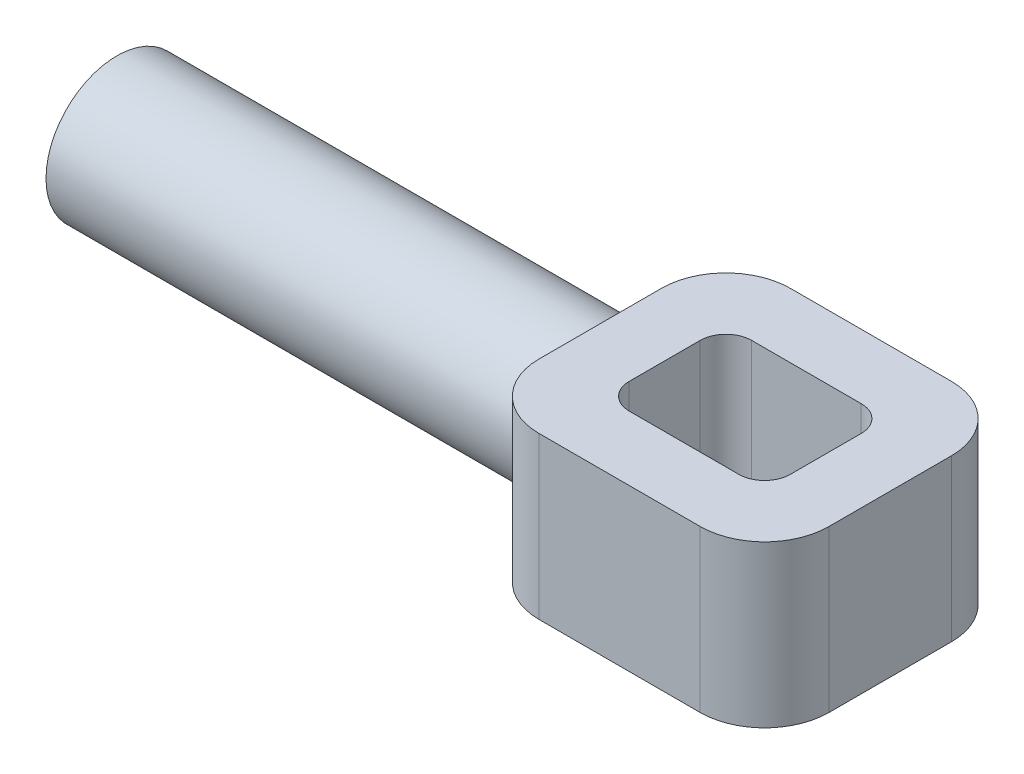
ISO-10303-21;
HEADER;
FILE_DESCRIPTION(('STEP AP214'),'2;1');
FILE_NAME('part.step','',(''),(''),'','','');
FILE_SCHEMA(('AUTOMOTIVE_DESIGN { 1 0 10303 214 1 1 1 1 }'));
ENDSEC;
DATA;
#1=APPLICATION_CONTEXT('core data for automotive mechanical design processes');
#2=APPLICATION_PROTOCOL_DEFINITION('international standard','automotive_design',2000,#1);
#3=PRODUCT_CONTEXT('',#1,'mechanical');
#4=PRODUCT('Part','Part','',(#3));
#5=PRODUCT_RELATED_PRODUCT_CATEGORY('part','',(#4));
#6=PRODUCT_DEFINITION_FORMATION('','',#4);
#7=PRODUCT_DEFINITION_CONTEXT('part definition',#1,'design');
#8=PRODUCT_DEFINITION('design','',#6,#7);
#9=PRODUCT_DEFINITION_SHAPE('','',#8);
#10=(LENGTH_UNIT() NAMED_UNIT(*) SI_UNIT(.MILLI.,.METRE.));
#11=(NAMED_UNIT(*) PLANE_ANGLE_UNIT() SI_UNIT($,.RADIAN.));
#12=(NAMED_UNIT(*) SI_UNIT($,.STERADIAN.) SOLID_ANGLE_UNIT());
#13=UNCERTAINTY_MEASURE_WITH_UNIT(LENGTH_MEASURE(1.E-05),#10,'distance_accuracy_value','');
#14=(GEOMETRIC_REPRESENTATION_CONTEXT(3) GLOBAL_UNCERTAINTY_ASSIGNED_CONTEXT((#13)) GLOBAL_UNIT_ASSIGNED_CONTEXT((#10,
#11,#12)) REPRESENTATION_CONTEXT('',''));
#15=CARTESIAN_POINT('',(0.,0.,0.));
#16=DIRECTION('',(0.,0.,1.));
#17=DIRECTION('',(1.,0.,0.));
#18=AXIS2_PLACEMENT_3D('',#15,#16,#17);
#19=CARTESIAN_POINT('',(-22.5,25.,-9.5));
#20=DIRECTION('',(1.,0.,0.));
#21=DIRECTION('',(0.,0.,-1.));
#22=AXIS2_PLACEMENT_3D('',#19,#20,#21);
#23=PLANE('',#22);
#24=CARTESIAN_POINT('',(-22.5,12.5,0.));
#25=DIRECTION('',(-1.,0.,0.));
#26=DIRECTION('',(0.,0.,1.));
#27=AXIS2_PLACEMENT_3D('',#24,#25,#26);
#28=CIRCLE('',#27,11.);
#29=CARTESIAN_POINT('',(-22.5,6.95473174679529,-9.5));
#30=VERTEX_POINT('',#29);
#31=CARTESIAN_POINT('',(-22.5,6.95473174679529,9.5));
#32=VERTEX_POINT('',#31);
#33=EDGE_CURVE('E76',#30,#32,#28,.T.);
#34=ORIENTED_EDGE('',*,*,#33,.F.);
#35=DIRECTION('',(0.,-1.,0.));
#36=VECTOR('',#35,1.);
#37=CARTESIAN_POINT('',(-22.5,25.,-9.5));
#38=LINE('',#37,#36);
#39=CARTESIAN_POINT('',(-22.5,0.,-9.5));
#40=VERTEX_POINT('',#39);
#41=EDGE_CURVE('E295',#30,#40,#38,.T.);
#42=ORIENTED_EDGE('',*,*,#41,.T.);
#43=DIRECTION('',(0.,0.,1.));
#44=VECTOR('',#43,1.);
#45=CARTESIAN_POINT('',(-22.5,0.,-9.5));
#46=LINE('',#45,#44);
#47=CARTESIAN_POINT('',(-22.5,0.,9.5));
#48=VERTEX_POINT('',#47);
#49=EDGE_CURVE('E267',#40,#48,#46,.T.);
#50=ORIENTED_EDGE('',*,*,#49,.T.);
#51=DIRECTION('',(0.,-1.,0.));
#52=VECTOR('',#51,1.);
#53=CARTESIAN_POINT('',(-22.5,25.,9.5));
#54=LINE('',#53,#52);
#55=EDGE_CURVE('E199',#48,#32,#54,.F.);
#56=ORIENTED_EDGE('',*,*,#55,.T.);
#57=EDGE_LOOP('',(#34,#42,#50,#56));
#58=FACE_BOUND('',#57,.T.);
#59=ADVANCED_FACE('F61',(#58),#23,.F.);
#60=CARTESIAN_POINT('',(0.,25.,0.));
#61=DIRECTION('',(0.,1.,0.));
#62=DIRECTION('',(0.,0.,1.));
#63=AXIS2_PLACEMENT_3D('',#60,#61,#62);
#64=PLANE('',#63);
#65=DIRECTION('',(0.,0.,-1.));
#66=VECTOR('',#65,1.);
#67=CARTESIAN_POINT('',(22.5,25.,-9.5));
#68=LINE('',#67,#66);
#69=CARTESIAN_POINT('',(22.5,25.,9.5));
#70=VERTEX_POINT('',#69);
#71=CARTESIAN_POINT('',(22.5,25.,-9.5));
#72=VERTEX_POINT('',#71);
#73=EDGE_CURVE('E249',#70,#72,#68,.T.);
#74=ORIENTED_EDGE('',*,*,#73,.T.);
#75=CARTESIAN_POINT('',(12.5,25.,-9.5));
#76=DIRECTION('',(0.,1.,0.));
#77=DIRECTION('',(0.,0.,1.));
#78=AXIS2_PLACEMENT_3D('',#75,#76,#77);
#79=CIRCLE('',#78,10.);
#80=CARTESIAN_POINT('',(12.5,25.,-19.5));
#81=VERTEX_POINT('',#80);
#82=EDGE_CURVE('E197',#72,#81,#79,.T.);
#83=ORIENTED_EDGE('',*,*,#82,.T.);
#84=DIRECTION('',(-1.,0.,0.));
#85=VECTOR('',#84,1.);
#86=CARTESIAN_POINT('',(-12.5,25.,-19.5));
#87=LINE('',#86,#85);
#88=CARTESIAN_POINT('',(-12.5,25.,-19.5));
#89=VERTEX_POINT('',#88);
#90=EDGE_CURVE('E252',#81,#89,#87,.T.);
#91=ORIENTED_EDGE('',*,*,#90,.T.);
#92=CARTESIAN_POINT('',(-12.5,25.,-9.5));
#93=DIRECTION('',(0.,1.,0.));
#94=DIRECTION('',(0.,0.,1.));
#95=AXIS2_PLACEMENT_3D('',#92,#93,#94);
#96=CIRCLE('',#95,10.);
#97=CARTESIAN_POINT('',(-22.5,25.,-9.5));
#98=VERTEX_POINT('',#97);
#99=EDGE_CURVE('E292',#89,#98,#96,.T.);
#100=ORIENTED_EDGE('',*,*,#99,.T.);
#101=DIRECTION('',(0.,0.,1.));
#102=VECTOR('',#101,1.);
#103=CARTESIAN_POINT('',(-22.5,25.,-9.5));
#104=LINE('',#103,#102);
#105=CARTESIAN_POINT('',(-22.5,25.,9.5));
#106=VERTEX_POINT('',#105);
#107=EDGE_CURVE('E256',#98,#106,#104,.T.);
#108=ORIENTED_EDGE('',*,*,#107,.T.);
#109=CARTESIAN_POINT('',(-12.5,25.,9.5));
#110=DIRECTION('',(0.,1.,0.));
#111=DIRECTION('',(0.,0.,1.));
#112=AXIS2_PLACEMENT_3D('',#109,#110,#111);
#113=CIRCLE('',#112,10.);
#114=CARTESIAN_POINT('',(-12.5,25.,19.5));
#115=VERTEX_POINT('',#114);
#116=EDGE_CURVE('E193',#106,#115,#113,.T.);
#117=ORIENTED_EDGE('',*,*,#116,.T.);
#118=DIRECTION('',(1.,0.,0.));
#119=VECTOR('',#118,1.);
#120=CARTESIAN_POINT('',(-12.5,25.,19.5));
#121=LINE('',#120,#119);
#122=CARTESIAN_POINT('',(12.5,25.,19.5));
#123=VERTEX_POINT('',#122);
#124=EDGE_CURVE('E258',#115,#123,#121,.T.);
#125=ORIENTED_EDGE('',*,*,#124,.T.);
#126=CARTESIAN_POINT('',(12.5,25.,9.5));
#127=DIRECTION('',(0.,1.,0.));
#128=DIRECTION('',(0.,0.,1.));
#129=AXIS2_PLACEMENT_3D('',#126,#127,#128);
#130=CIRCLE('',#129,10.);
#131=EDGE_CURVE('E289',#123,#70,#130,.T.);
#132=ORIENTED_EDGE('',*,*,#131,.T.);
#133=EDGE_LOOP('',(#74,#83,#91,#100,#108,#117,#125,#132));
#134=FACE_BOUND('',#133,.T.);
#135=DIRECTION('',(-1.,0.,0.));
#136=VECTOR('',#135,1.);
#137=CARTESIAN_POINT('',(-12.5,25.,-9.5));
#138=LINE('',#137,#136);
#139=CARTESIAN_POINT('',(8.5,25.,-9.5));
#140=VERTEX_POINT('',#139);
#141=CARTESIAN_POINT('',(-8.5,25.,-9.5));
#142=VERTEX_POINT('',#141);
#143=EDGE_CURVE('E228',#140,#142,#138,.T.);
#144=ORIENTED_EDGE('',*,*,#143,.F.);
#145=CARTESIAN_POINT('',(8.5,25.,-5.5));
#146=DIRECTION('',(0.,1.,0.));
#147=DIRECTION('',(0.,0.,1.));
#148=AXIS2_PLACEMENT_3D('',#145,#146,#147);
#149=CIRCLE('',#148,4.);
#150=CARTESIAN_POINT('',(12.5,25.,-5.5));
#151=VERTEX_POINT('',#150);
#152=EDGE_CURVE('E328',#140,#151,#149,.F.);
#153=ORIENTED_EDGE('',*,*,#152,.T.);
#154=DIRECTION('',(0.,0.,-1.));
#155=VECTOR('',#154,1.);
#156=CARTESIAN_POINT('',(12.5,25.,-9.5));
#157=LINE('',#156,#155);
#158=CARTESIAN_POINT('',(12.5,25.,5.5));
#159=VERTEX_POINT('',#158);
#160=EDGE_CURVE('E225',#159,#151,#157,.T.);
#161=ORIENTED_EDGE('',*,*,#160,.F.);
#162=CARTESIAN_POINT('',(8.5,25.,5.5));
#163=DIRECTION('',(0.,1.,0.));
#164=DIRECTION('',(0.,0.,1.));
#165=AXIS2_PLACEMENT_3D('',#162,#163,#164);
#166=CIRCLE('',#165,4.);
#167=CARTESIAN_POINT('',(8.5,25.,9.5));
#168=VERTEX_POINT('',#167);
#169=EDGE_CURVE('E12',#159,#168,#166,.F.);
#170=ORIENTED_EDGE('',*,*,#169,.T.);
#171=DIRECTION('',(1.,0.,0.));
#172=VECTOR('',#171,1.);
#173=CARTESIAN_POINT('',(-12.5,25.,9.5));
#174=LINE('',#173,#172);
#175=CARTESIAN_POINT('',(-8.5,25.,9.5));
#176=VERTEX_POINT('',#175);
#177=EDGE_CURVE('E235',#176,#168,#174,.T.);
#178=ORIENTED_EDGE('',*,*,#177,.F.);
#179=CARTESIAN_POINT('',(-8.5,25.,5.5));
#180=DIRECTION('',(0.,1.,0.));
#181=DIRECTION('',(0.,0.,1.));
#182=AXIS2_PLACEMENT_3D('',#179,#180,#181);
#183=CIRCLE('',#182,4.);
#184=CARTESIAN_POINT('',(-12.5,25.,5.5));
#185=VERTEX_POINT('',#184);
#186=EDGE_CURVE('E332',#176,#185,#183,.F.);
#187=ORIENTED_EDGE('',*,*,#186,.T.);
#188=DIRECTION('',(0.,0.,1.));
#189=VECTOR('',#188,1.);
#190=CARTESIAN_POINT('',(-12.5,25.,-9.5));
#191=LINE('',#190,#189);
#192=CARTESIAN_POINT('',(-12.5,25.,-5.5));
#193=VERTEX_POINT('',#192);
#194=EDGE_CURVE('E232',#193,#185,#191,.T.);
#195=ORIENTED_EDGE('',*,*,#194,.F.);
#196=CARTESIAN_POINT('',(-8.5,25.,-5.5));
#197=DIRECTION('',(0.,1.,0.));
#198=DIRECTION('',(0.,0.,1.));
#199=AXIS2_PLACEMENT_3D('',#196,#197,#198);
#200=CIRCLE('',#199,4.);
#201=EDGE_CURVE('E324',#193,#142,#200,.F.);
#202=ORIENTED_EDGE('',*,*,#201,.T.);
#203=EDGE_LOOP('',(#144,#153,#161,#170,#178,#187,#195,#202));
#204=FACE_BOUND('',#203,.T.);
#205=ADVANCED_FACE('F348',(#134,#204),#64,.T.);
#206=CARTESIAN_POINT('',(0.,0.,0.));
#207=DIRECTION('',(0.,1.,0.));
#208=DIRECTION('',(0.,0.,1.));
#209=AXIS2_PLACEMENT_3D('',#206,#207,#208);
#210=PLANE('',#209);
#211=DIRECTION('',(-1.,0.,0.));
#212=VECTOR('',#211,1.);
#213=CARTESIAN_POINT('',(-12.5,0.,-19.5));
#214=LINE('',#213,#212);
#215=CARTESIAN_POINT('',(12.5,0.,-19.5));
#216=VERTEX_POINT('',#215);
#217=CARTESIAN_POINT('',(-12.5,0.,-19.5));
#218=VERTEX_POINT('',#217);
#219=EDGE_CURVE('E264',#216,#218,#214,.T.);
#220=ORIENTED_EDGE('',*,*,#219,.F.);
#221=CARTESIAN_POINT('',(12.5,0.,-9.5));
#222=DIRECTION('',(0.,1.,0.));
#223=DIRECTION('',(0.,0.,1.));
#224=AXIS2_PLACEMENT_3D('',#221,#222,#223);
#225=CIRCLE('',#224,10.);
#226=CARTESIAN_POINT('',(22.5,0.,-9.5));
#227=VERTEX_POINT('',#226);
#228=EDGE_CURVE('E282',#216,#227,#225,.F.);
#229=ORIENTED_EDGE('',*,*,#228,.T.);
#230=DIRECTION('',(0.,0.,-1.));
#231=VECTOR('',#230,1.);
#232=CARTESIAN_POINT('',(22.5,0.,-9.5));
#233=LINE('',#232,#231);
#234=CARTESIAN_POINT('',(22.5,0.,9.5));
#235=VERTEX_POINT('',#234);
#236=EDGE_CURVE('E238',#235,#227,#233,.T.);
#237=ORIENTED_EDGE('',*,*,#236,.F.);
#238=CARTESIAN_POINT('',(12.5,0.,9.5));
#239=DIRECTION('',(0.,1.,0.));
#240=DIRECTION('',(0.,0.,1.));
#241=AXIS2_PLACEMENT_3D('',#238,#239,#240);
#242=CIRCLE('',#241,10.);
#243=CARTESIAN_POINT('',(12.5,0.,19.5));
#244=VERTEX_POINT('',#243);
#245=EDGE_CURVE('E276',#235,#244,#242,.F.);
#246=ORIENTED_EDGE('',*,*,#245,.T.);
#247=DIRECTION('',(1.,0.,0.));
#248=VECTOR('',#247,1.);
#249=CARTESIAN_POINT('',(-12.5,0.,19.5));
#250=LINE('',#249,#248);
#251=CARTESIAN_POINT('',(-12.5,0.,19.5));
#252=VERTEX_POINT('',#251);
#253=EDGE_CURVE('E253',#252,#244,#250,.T.);
#254=ORIENTED_EDGE('',*,*,#253,.F.);
#255=CARTESIAN_POINT('',(-12.5,0.,9.5));
#256=DIRECTION('',(0.,1.,0.));
#257=DIRECTION('',(0.,0.,1.));
#258=AXIS2_PLACEMENT_3D('',#255,#256,#257);
#259=CIRCLE('',#258,10.);
#260=EDGE_CURVE('E278',#252,#48,#259,.F.);
#261=ORIENTED_EDGE('',*,*,#260,.T.);
#262=ORIENTED_EDGE('',*,*,#49,.F.);
#263=CARTESIAN_POINT('',(-12.5,0.,-9.5));
#264=DIRECTION('',(0.,1.,0.));
#265=DIRECTION('',(0.,0.,1.));
#266=AXIS2_PLACEMENT_3D('',#263,#264,#265);
#267=CIRCLE('',#266,10.);
#268=EDGE_CURVE('E280',#40,#218,#267,.F.);
#269=ORIENTED_EDGE('',*,*,#268,.T.);
#270=EDGE_LOOP('',(#220,#229,#237,#246,#254,#261,#262,#269));
#271=FACE_BOUND('',#270,.T.);
#272=DIRECTION('',(1.,0.,0.));
#273=VECTOR('',#272,1.);
#274=CARTESIAN_POINT('',(-12.5,0.,9.5));
#275=LINE('',#274,#273);
#276=CARTESIAN_POINT('',(-8.5,0.,9.5));
#277=VERTEX_POINT('',#276);
#278=CARTESIAN_POINT('',(8.5,0.,9.5));
#279=VERTEX_POINT('',#278);
#280=EDGE_CURVE('E229',#277,#279,#275,.T.);
#281=ORIENTED_EDGE('',*,*,#280,.T.);
#282=CARTESIAN_POINT('',(8.5,0.,5.5));
#283=DIRECTION('',(0.,1.,0.));
#284=DIRECTION('',(0.,0.,1.));
#285=AXIS2_PLACEMENT_3D('',#282,#283,#284);
#286=CIRCLE('',#285,4.);
#287=CARTESIAN_POINT('',(12.5,0.,5.5));
#288=VERTEX_POINT('',#287);
#289=EDGE_CURVE('E69',#279,#288,#286,.T.);
#290=ORIENTED_EDGE('',*,*,#289,.T.);
#291=DIRECTION('',(0.,0.,-1.));
#292=VECTOR('',#291,1.);
#293=CARTESIAN_POINT('',(12.5,0.,-9.5));
#294=LINE('',#293,#292);
#295=CARTESIAN_POINT('',(12.5,0.,-5.5));
#296=VERTEX_POINT('',#295);
#297=EDGE_CURVE('E224',#288,#296,#294,.T.);
#298=ORIENTED_EDGE('',*,*,#297,.T.);
#299=CARTESIAN_POINT('',(8.5,0.,-5.5));
#300=DIRECTION('',(0.,1.,0.));
#301=DIRECTION('',(0.,0.,1.));
#302=AXIS2_PLACEMENT_3D('',#299,#300,#301);
#303=CIRCLE('',#302,4.);
#304=CARTESIAN_POINT('',(8.5,0.,-9.5));
#305=VERTEX_POINT('',#304);
#306=EDGE_CURVE('E326',#296,#305,#303,.T.);
#307=ORIENTED_EDGE('',*,*,#306,.T.);
#308=DIRECTION('',(-1.,0.,0.));
#309=VECTOR('',#308,1.);
#310=CARTESIAN_POINT('',(-12.5,0.,-9.5));
#311=LINE('',#310,#309);
#312=CARTESIAN_POINT('',(-8.5,0.,-9.5));
#313=VERTEX_POINT('',#312);
#314=EDGE_CURVE('E241',#305,#313,#311,.T.);
#315=ORIENTED_EDGE('',*,*,#314,.T.);
#316=CARTESIAN_POINT('',(-8.5,0.,-5.5));
#317=DIRECTION('',(0.,1.,0.));
#318=DIRECTION('',(0.,0.,1.));
#319=AXIS2_PLACEMENT_3D('',#316,#317,#318);
#320=CIRCLE('',#319,4.);
#321=CARTESIAN_POINT('',(-12.5,0.,-5.5));
#322=VERTEX_POINT('',#321);
#323=EDGE_CURVE('E322',#313,#322,#320,.T.);
#324=ORIENTED_EDGE('',*,*,#323,.T.);
#325=DIRECTION('',(0.,0.,1.));
#326=VECTOR('',#325,1.);
#327=CARTESIAN_POINT('',(-12.5,0.,-9.5));
#328=LINE('',#327,#326);
#329=CARTESIAN_POINT('',(-12.5,0.,5.5));
#330=VERTEX_POINT('',#329);
#331=EDGE_CURVE('E244',#322,#330,#328,.T.);
#332=ORIENTED_EDGE('',*,*,#331,.T.);
#333=CARTESIAN_POINT('',(-8.5,0.,5.5));
#334=DIRECTION('',(0.,1.,0.));
#335=DIRECTION('',(0.,0.,1.));
#336=AXIS2_PLACEMENT_3D('',#333,#334,#335);
#337=CIRCLE('',#336,4.);
#338=EDGE_CURVE('E330',#330,#277,#337,.T.);
#339=ORIENTED_EDGE('',*,*,#338,.T.);
#340=EDGE_LOOP('',(#281,#290,#298,#307,#315,#324,#332,#339));
#341=FACE_BOUND('',#340,.T.);
#342=ADVANCED_FACE('F335',(#271,#341),#210,.F.);
#343=CARTESIAN_POINT('',(22.5,25.,-9.5));
#344=DIRECTION('',(-1.,0.,0.));
#345=DIRECTION('',(0.,0.,1.));
#346=AXIS2_PLACEMENT_3D('',#343,#344,#345);
#347=PLANE('',#346);
#348=ORIENTED_EDGE('',*,*,#236,.T.);
#349=DIRECTION('',(0.,-1.,0.));
#350=VECTOR('',#349,1.);
#351=CARTESIAN_POINT('',(22.5,25.,-9.5));
#352=LINE('',#351,#350);
#353=EDGE_CURVE('E287',#227,#72,#352,.F.);
#354=ORIENTED_EDGE('',*,*,#353,.T.);
#355=ORIENTED_EDGE('',*,*,#73,.F.);
#356=DIRECTION('',(0.,-1.,0.));
#357=VECTOR('',#356,1.);
#358=CARTESIAN_POINT('',(22.5,25.,9.5));
#359=LINE('',#358,#357);
#360=EDGE_CURVE('E284',#70,#235,#359,.T.);
#361=ORIENTED_EDGE('',*,*,#360,.T.);
#362=EDGE_LOOP('',(#348,#354,#355,#361));
#363=FACE_BOUND('',#362,.T.);
#364=ADVANCED_FACE('F397',(#363),#347,.F.);
#365=CARTESIAN_POINT('',(-12.5,25.,-19.5));
#366=DIRECTION('',(0.,0.,1.));
#367=DIRECTION('',(1.,0.,0.));
#368=AXIS2_PLACEMENT_3D('',#365,#366,#367);
#369=PLANE('',#368);
#370=ORIENTED_EDGE('',*,*,#90,.F.);
#371=DIRECTION('',(0.,-1.,0.));
#372=VECTOR('',#371,1.);
#373=CARTESIAN_POINT('',(12.5,25.,-19.5));
#374=LINE('',#373,#372);
#375=EDGE_CURVE('E273',#81,#216,#374,.T.);
#376=ORIENTED_EDGE('',*,*,#375,.T.);
#377=ORIENTED_EDGE('',*,*,#219,.T.);
#378=DIRECTION('',(0.,-1.,0.));
#379=VECTOR('',#378,1.);
#380=CARTESIAN_POINT('',(-12.5,25.,-19.5));
#381=LINE('',#380,#379);
#382=EDGE_CURVE('E261',#218,#89,#381,.F.);
#383=ORIENTED_EDGE('',*,*,#382,.T.);
#384=EDGE_LOOP('',(#370,#376,#377,#383));
#385=FACE_BOUND('',#384,.T.);
#386=ADVANCED_FACE('F391',(#385),#369,.F.);
#387=CARTESIAN_POINT('',(-22.5,18.0452682532047,9.5));
#388=VERTEX_POINT('',#387);
#389=CARTESIAN_POINT('',(-22.5,18.0452682532047,-9.5));
#390=VERTEX_POINT('',#389);
#391=EDGE_CURVE('E201',#388,#390,#28,.T.);
#392=ORIENTED_EDGE('',*,*,#391,.F.);
#393=EDGE_CURVE('E186',#388,#106,#54,.F.);
#394=ORIENTED_EDGE('',*,*,#393,.T.);
#395=ORIENTED_EDGE('',*,*,#107,.F.);
#396=EDGE_CURVE('E203',#98,#390,#38,.T.);
#397=ORIENTED_EDGE('',*,*,#396,.T.);
#398=EDGE_LOOP('',(#392,#394,#395,#397));
#399=FACE_BOUND('',#398,.T.);
#400=ADVANCED_FACE('F202',(#399),#23,.F.);
#401=CARTESIAN_POINT('',(-12.5,25.,19.5));
#402=DIRECTION('',(0.,0.,-1.));
#403=DIRECTION('',(-1.,0.,0.));
#404=AXIS2_PLACEMENT_3D('',#401,#402,#403);
#405=PLANE('',#404);
#406=ORIENTED_EDGE('',*,*,#124,.F.);
#407=DIRECTION('',(0.,-1.,0.));
#408=VECTOR('',#407,1.);
#409=CARTESIAN_POINT('',(-12.5,25.,19.5));
#410=LINE('',#409,#408);
#411=EDGE_CURVE('E299',#115,#252,#410,.T.);
#412=ORIENTED_EDGE('',*,*,#411,.T.);
#413=ORIENTED_EDGE('',*,*,#253,.T.);
#414=DIRECTION('',(0.,-1.,0.));
#415=VECTOR('',#414,1.);
#416=CARTESIAN_POINT('',(12.5,25.,19.5));
#417=LINE('',#416,#415);
#418=EDGE_CURVE('E297',#244,#123,#417,.F.);
#419=ORIENTED_EDGE('',*,*,#418,.T.);
#420=EDGE_LOOP('',(#406,#412,#413,#419));
#421=FACE_BOUND('',#420,.T.);
#422=ADVANCED_FACE('F390',(#421),#405,.F.);
#423=CARTESIAN_POINT('',(12.5,25.,-9.5));
#424=DIRECTION('',(-1.,0.,0.));
#425=DIRECTION('',(0.,0.,1.));
#426=AXIS2_PLACEMENT_3D('',#423,#424,#425);
#427=PLANE('',#426);
#428=ORIENTED_EDGE('',*,*,#160,.T.);
#429=DIRECTION('',(0.,-1.,0.));
#430=VECTOR('',#429,1.);
#431=CARTESIAN_POINT('',(12.5,0.,-5.5));
#432=LINE('',#431,#430);
#433=EDGE_CURVE('E314',#151,#296,#432,.T.);
#434=ORIENTED_EDGE('',*,*,#433,.T.);
#435=ORIENTED_EDGE('',*,*,#297,.F.);
#436=DIRECTION('',(0.,-1.,0.));
#437=VECTOR('',#436,1.);
#438=CARTESIAN_POINT('',(12.5,25.,5.5));
#439=LINE('',#438,#437);
#440=EDGE_CURVE('E312',#288,#159,#439,.F.);
#441=ORIENTED_EDGE('',*,*,#440,.T.);
#442=EDGE_LOOP('',(#428,#434,#435,#441));
#443=FACE_BOUND('',#442,.T.);
#444=ADVANCED_FACE('F341',(#443),#427,.T.);
#445=CARTESIAN_POINT('',(-12.5,25.,-9.5));
#446=DIRECTION('',(0.,0.,1.));
#447=DIRECTION('',(1.,0.,0.));
#448=AXIS2_PLACEMENT_3D('',#445,#446,#447);
#449=PLANE('',#448);
#450=ORIENTED_EDGE('',*,*,#143,.T.);
#451=DIRECTION('',(0.,-1.,0.));
#452=VECTOR('',#451,1.);
#453=CARTESIAN_POINT('',(-8.5,0.,-9.5));
#454=LINE('',#453,#452);
#455=EDGE_CURVE('E304',#142,#313,#454,.T.);
#456=ORIENTED_EDGE('',*,*,#455,.T.);
#457=ORIENTED_EDGE('',*,*,#314,.F.);
#458=DIRECTION('',(0.,-1.,0.));
#459=VECTOR('',#458,1.);
#460=CARTESIAN_POINT('',(8.5,25.,-9.5));
#461=LINE('',#460,#459);
#462=EDGE_CURVE('E302',#305,#140,#461,.F.);
#463=ORIENTED_EDGE('',*,*,#462,.T.);
#464=EDGE_LOOP('',(#450,#456,#457,#463));
#465=FACE_BOUND('',#464,.T.);
#466=ADVANCED_FACE('F367',(#465),#449,.T.);
#467=CARTESIAN_POINT('',(-12.5,25.,-9.5));
#468=DIRECTION('',(1.,0.,0.));
#469=DIRECTION('',(0.,0.,-1.));
#470=AXIS2_PLACEMENT_3D('',#467,#468,#469);
#471=PLANE('',#470);
#472=ORIENTED_EDGE('',*,*,#331,.F.);
#473=DIRECTION('',(0.,-1.,0.));
#474=VECTOR('',#473,1.);
#475=CARTESIAN_POINT('',(-12.5,25.,-5.5));
#476=LINE('',#475,#474);
#477=EDGE_CURVE('E310',#322,#193,#476,.F.);
#478=ORIENTED_EDGE('',*,*,#477,.T.);
#479=ORIENTED_EDGE('',*,*,#194,.T.);
#480=DIRECTION('',(0.,-1.,0.));
#481=VECTOR('',#480,1.);
#482=CARTESIAN_POINT('',(-12.5,0.,5.5));
#483=LINE('',#482,#481);
#484=EDGE_CURVE('E307',#185,#330,#483,.T.);
#485=ORIENTED_EDGE('',*,*,#484,.T.);
#486=EDGE_LOOP('',(#472,#478,#479,#485));
#487=FACE_BOUND('',#486,.T.);
#488=ADVANCED_FACE('F360',(#487),#471,.T.);
#489=CARTESIAN_POINT('',(-12.5,25.,9.5));
#490=DIRECTION('',(0.,0.,-1.));
#491=DIRECTION('',(-1.,0.,0.));
#492=AXIS2_PLACEMENT_3D('',#489,#490,#491);
#493=PLANE('',#492);
#494=ORIENTED_EDGE('',*,*,#280,.F.);
#495=DIRECTION('',(0.,-1.,0.));
#496=VECTOR('',#495,1.);
#497=CARTESIAN_POINT('',(-8.5,25.,9.5));
#498=LINE('',#497,#496);
#499=EDGE_CURVE('E320',#277,#176,#498,.F.);
#500=ORIENTED_EDGE('',*,*,#499,.T.);
#501=ORIENTED_EDGE('',*,*,#177,.T.);
#502=DIRECTION('',(0.,-1.,0.));
#503=VECTOR('',#502,1.);
#504=CARTESIAN_POINT('',(8.5,0.,9.5));
#505=LINE('',#504,#503);
#506=EDGE_CURVE('E317',#168,#279,#505,.T.);
#507=ORIENTED_EDGE('',*,*,#506,.T.);
#508=EDGE_LOOP('',(#494,#500,#501,#507));
#509=FACE_BOUND('',#508,.T.);
#510=ADVANCED_FACE('F351',(#509),#493,.T.);
#511=CARTESIAN_POINT('',(12.5,25.,-9.5));
#512=DIRECTION('',(0.,-1.,0.));
#513=DIRECTION('',(0.,0.,-1.));
#514=AXIS2_PLACEMENT_3D('',#511,#512,#513);
#515=CYLINDRICAL_SURFACE('',#514,10.);
#516=ORIENTED_EDGE('',*,*,#82,.F.);
#517=ORIENTED_EDGE('',*,*,#353,.F.);
#518=ORIENTED_EDGE('',*,*,#228,.F.);
#519=ORIENTED_EDGE('',*,*,#375,.F.);
#520=EDGE_LOOP('',(#516,#517,#518,#519));
#521=FACE_BOUND('',#520,.T.);
#522=ADVANCED_FACE('F406',(#521),#515,.T.);
#523=CARTESIAN_POINT('',(-12.5,25.,-9.5));
#524=DIRECTION('',(0.,-1.,0.));
#525=DIRECTION('',(0.,0.,-1.));
#526=AXIS2_PLACEMENT_3D('',#523,#524,#525);
#527=CYLINDRICAL_SURFACE('',#526,10.);
#528=ORIENTED_EDGE('',*,*,#99,.F.);
#529=ORIENTED_EDGE('',*,*,#382,.F.);
#530=ORIENTED_EDGE('',*,*,#268,.F.);
#531=ORIENTED_EDGE('',*,*,#41,.F.);
#532=DIRECTION('',(0.,-1.,0.));
#533=VECTOR('',#532,1.);
#534=CARTESIAN_POINT('',(-22.5,25.,-9.5));
#535=LINE('',#534,#533);
#536=EDGE_CURVE('E83',#30,#390,#535,.F.);
#537=ORIENTED_EDGE('',*,*,#536,.T.);
#538=ORIENTED_EDGE('',*,*,#396,.F.);
#539=EDGE_LOOP('',(#528,#529,#530,#531,#537,#538));
#540=FACE_BOUND('',#539,.T.);
#541=ADVANCED_FACE('F409',(#540),#527,.T.);
#542=CARTESIAN_POINT('',(-12.5,25.,9.5));
#543=DIRECTION('',(0.,-1.,0.));
#544=DIRECTION('',(0.,0.,-1.));
#545=AXIS2_PLACEMENT_3D('',#542,#543,#544);
#546=CYLINDRICAL_SURFACE('',#545,10.);
#547=ORIENTED_EDGE('',*,*,#116,.F.);
#548=ORIENTED_EDGE('',*,*,#393,.F.);
#549=EDGE_CURVE('E191',#32,#388,#54,.F.);
#550=ORIENTED_EDGE('',*,*,#549,.F.);
#551=ORIENTED_EDGE('',*,*,#55,.F.);
#552=ORIENTED_EDGE('',*,*,#260,.F.);
#553=ORIENTED_EDGE('',*,*,#411,.F.);
#554=EDGE_LOOP('',(#547,#548,#550,#551,#552,#553));
#555=FACE_BOUND('',#554,.T.);
#556=ADVANCED_FACE('F188',(#555),#546,.T.);
#557=CARTESIAN_POINT('',(12.5,25.,9.5));
#558=DIRECTION('',(0.,-1.,0.));
#559=DIRECTION('',(0.,0.,-1.));
#560=AXIS2_PLACEMENT_3D('',#557,#558,#559);
#561=CYLINDRICAL_SURFACE('',#560,10.);
#562=ORIENTED_EDGE('',*,*,#131,.F.);
#563=ORIENTED_EDGE('',*,*,#418,.F.);
#564=ORIENTED_EDGE('',*,*,#245,.F.);
#565=ORIENTED_EDGE('',*,*,#360,.F.);
#566=EDGE_LOOP('',(#562,#563,#564,#565));
#567=FACE_BOUND('',#566,.T.);
#568=ADVANCED_FACE('F378',(#567),#561,.T.);
#569=CARTESIAN_POINT('',(-8.5,25.,-5.5));
#570=DIRECTION('',(0.,1.,0.));
#571=DIRECTION('',(0.,0.,1.));
#572=AXIS2_PLACEMENT_3D('',#569,#570,#571);
#573=CYLINDRICAL_SURFACE('',#572,4.);
#574=ORIENTED_EDGE('',*,*,#201,.F.);
#575=ORIENTED_EDGE('',*,*,#477,.F.);
#576=ORIENTED_EDGE('',*,*,#323,.F.);
#577=ORIENTED_EDGE('',*,*,#455,.F.);
#578=EDGE_LOOP('',(#574,#575,#576,#577));
#579=FACE_BOUND('',#578,.T.);
#580=ADVANCED_FACE('F363',(#579),#573,.F.);
#581=CARTESIAN_POINT('',(8.5,25.,-5.5));
#582=DIRECTION('',(0.,1.,0.));
#583=DIRECTION('',(0.,0.,1.));
#584=AXIS2_PLACEMENT_3D('',#581,#582,#583);
#585=CYLINDRICAL_SURFACE('',#584,4.);
#586=ORIENTED_EDGE('',*,*,#152,.F.);
#587=ORIENTED_EDGE('',*,*,#462,.F.);
#588=ORIENTED_EDGE('',*,*,#306,.F.);
#589=ORIENTED_EDGE('',*,*,#433,.F.);
#590=EDGE_LOOP('',(#586,#587,#588,#589));
#591=FACE_BOUND('',#590,.T.);
#592=ADVANCED_FACE('F371',(#591),#585,.F.);
#593=CARTESIAN_POINT('',(-8.5,25.,5.5));
#594=DIRECTION('',(0.,1.,0.));
#595=DIRECTION('',(0.,0.,1.));
#596=AXIS2_PLACEMENT_3D('',#593,#594,#595);
#597=CYLINDRICAL_SURFACE('',#596,4.);
#598=ORIENTED_EDGE('',*,*,#186,.F.);
#599=ORIENTED_EDGE('',*,*,#499,.F.);
#600=ORIENTED_EDGE('',*,*,#338,.F.);
#601=ORIENTED_EDGE('',*,*,#484,.F.);
#602=EDGE_LOOP('',(#598,#599,#600,#601));
#603=FACE_BOUND('',#602,.T.);
#604=ADVANCED_FACE('F354',(#603),#597,.F.);
#605=CARTESIAN_POINT('',(8.5,25.,5.5));
#606=DIRECTION('',(0.,1.,0.));
#607=DIRECTION('',(0.,0.,1.));
#608=AXIS2_PLACEMENT_3D('',#605,#606,#607);
#609=CYLINDRICAL_SURFACE('',#608,4.);
#610=ORIENTED_EDGE('',*,*,#169,.F.);
#611=ORIENTED_EDGE('',*,*,#440,.F.);
#612=ORIENTED_EDGE('',*,*,#289,.F.);
#613=ORIENTED_EDGE('',*,*,#506,.F.);
#614=EDGE_LOOP('',(#610,#611,#612,#613));
#615=FACE_BOUND('',#614,.T.);
#616=ADVANCED_FACE('F63',(#615),#609,.F.);
#617=CARTESIAN_POINT('',(-22.5,12.5,0.));
#618=DIRECTION('',(-1.,0.,0.));
#619=DIRECTION('',(0.,0.,1.));
#620=AXIS2_PLACEMENT_3D('',#617,#618,#619);
#621=PLANE('',#620);
#622=EDGE_CURVE('E211',#32,#388,#28,.T.);
#623=ORIENTED_EDGE('',*,*,#622,.F.);
#624=ORIENTED_EDGE('',*,*,#549,.T.);
#625=EDGE_LOOP('',(#623,#624));
#626=FACE_BOUND('',#625,.T.);
#627=ADVANCED_FACE('F214',(#626),#621,.F.);
#628=CARTESIAN_POINT('',(-97.5,12.5,0.));
#629=DIRECTION('',(1.,0.,0.));
#630=DIRECTION('',(0.,0.,-1.));
#631=AXIS2_PLACEMENT_3D('',#628,#629,#630);
#632=CYLINDRICAL_SURFACE('',#631,11.);
#633=CARTESIAN_POINT('',(-97.5,12.5,0.));
#634=DIRECTION('',(-1.,0.,0.));
#635=DIRECTION('',(0.,0.,1.));
#636=AXIS2_PLACEMENT_3D('',#633,#634,#635);
#637=CIRCLE('',#636,11.);
#638=CARTESIAN_POINT('',(-97.5,12.5,11.));
#639=VERTEX_POINT('',#638);
#640=EDGE_CURVE('E208',#639,#639,#637,.T.);
#641=ORIENTED_EDGE('',*,*,#640,.F.);
#642=EDGE_LOOP('',(#641));
#643=FACE_BOUND('',#642,.T.);
#644=ORIENTED_EDGE('',*,*,#391,.T.);
#645=EDGE_CURVE('E209',#390,#30,#28,.T.);
#646=ORIENTED_EDGE('',*,*,#645,.T.);
#647=ORIENTED_EDGE('',*,*,#33,.T.);
#648=ORIENTED_EDGE('',*,*,#622,.T.);
#649=EDGE_LOOP('',(#644,#646,#647,#648));
#650=FACE_BOUND('',#649,.T.);
#651=ADVANCED_FACE('F215',(#643,#650),#632,.T.);
#652=CARTESIAN_POINT('',(-97.5,12.5,0.));
#653=DIRECTION('',(-1.,0.,0.));
#654=DIRECTION('',(0.,0.,1.));
#655=AXIS2_PLACEMENT_3D('',#652,#653,#654);
#656=PLANE('',#655);
#657=CARTESIAN_POINT('',(-97.5,12.5,0.));
#658=DIRECTION('',(-1.,0.,0.));
#659=DIRECTION('',(0.,0.,1.));
#660=AXIS2_PLACEMENT_3D('',#657,#658,#659);
#661=CIRCLE('',#660,7.85);
#662=CARTESIAN_POINT('',(-97.5,12.5,7.85000000000002));
#663=VERTEX_POINT('',#662);
#664=EDGE_CURVE('E218',#663,#663,#661,.T.);
#665=ORIENTED_EDGE('',*,*,#664,.F.);
#666=EDGE_LOOP('',(#665));
#667=FACE_BOUND('',#666,.T.);
#668=ORIENTED_EDGE('',*,*,#640,.T.);
#669=EDGE_LOOP('',(#668));
#670=FACE_BOUND('',#669,.T.);
#671=ADVANCED_FACE('F439',(#667,#670),#656,.T.);
#672=ORIENTED_EDGE('',*,*,#536,.F.);
#673=ORIENTED_EDGE('',*,*,#645,.F.);
#674=EDGE_LOOP('',(#672,#673));
#675=FACE_BOUND('',#674,.T.);
#676=ADVANCED_FACE('F436',(#675),#621,.F.);
#677=CARTESIAN_POINT('',(-67.5,12.5,0.));
#678=DIRECTION('',(-1.,0.,0.));
#679=DIRECTION('',(0.,0.,1.));
#680=AXIS2_PLACEMENT_3D('',#677,#678,#679);
#681=CYLINDRICAL_SURFACE('',#680,7.85);
#682=CARTESIAN_POINT('',(-67.5,12.5,0.));
#683=DIRECTION('',(-1.,0.,0.));
#684=DIRECTION('',(0.,0.,1.));
#685=AXIS2_PLACEMENT_3D('',#682,#683,#684);
#686=CIRCLE('',#685,7.85);
#687=CARTESIAN_POINT('',(-67.5,12.5,7.85000000000001));
#688=VERTEX_POINT('',#687);
#689=EDGE_CURVE('E216',#688,#688,#686,.T.);
#690=ORIENTED_EDGE('',*,*,#689,.F.);
#691=EDGE_LOOP('',(#690));
#692=FACE_BOUND('',#691,.T.);
#693=ORIENTED_EDGE('',*,*,#664,.T.);
#694=EDGE_LOOP('',(#693));
#695=FACE_BOUND('',#694,.T.);
#696=ADVANCED_FACE('F438',(#692,#695),#681,.F.);
#697=CARTESIAN_POINT('',(-67.5,12.5,0.));
#698=DIRECTION('',(-1.,0.,0.));
#699=DIRECTION('',(0.,0.,1.));
#700=AXIS2_PLACEMENT_3D('',#697,#698,#699);
#701=PLANE('',#700);
#702=ORIENTED_EDGE('',*,*,#689,.T.);
#703=EDGE_LOOP('',(#702));
#704=FACE_BOUND('',#703,.T.);
#705=ADVANCED_FACE('F445',(#704),#701,.T.);
#706=CLOSED_SHELL('',(#59,#205,#342,#364,#386,#400,#422,#444,#466,#488,#510,#522,#541,#556,#568,
#580,#592,#604,#616,#627,#651,#671,#676,#696,#705));
#707=MANIFOLD_SOLID_BREP('B2',#706);
#708=ADVANCED_BREP_SHAPE_REPRESENTATION('',(#18,#707),#14);
#709=SHAPE_DEFINITION_REPRESENTATION(#9,#708);
ENDSEC;
END-ISO-10303-21;
